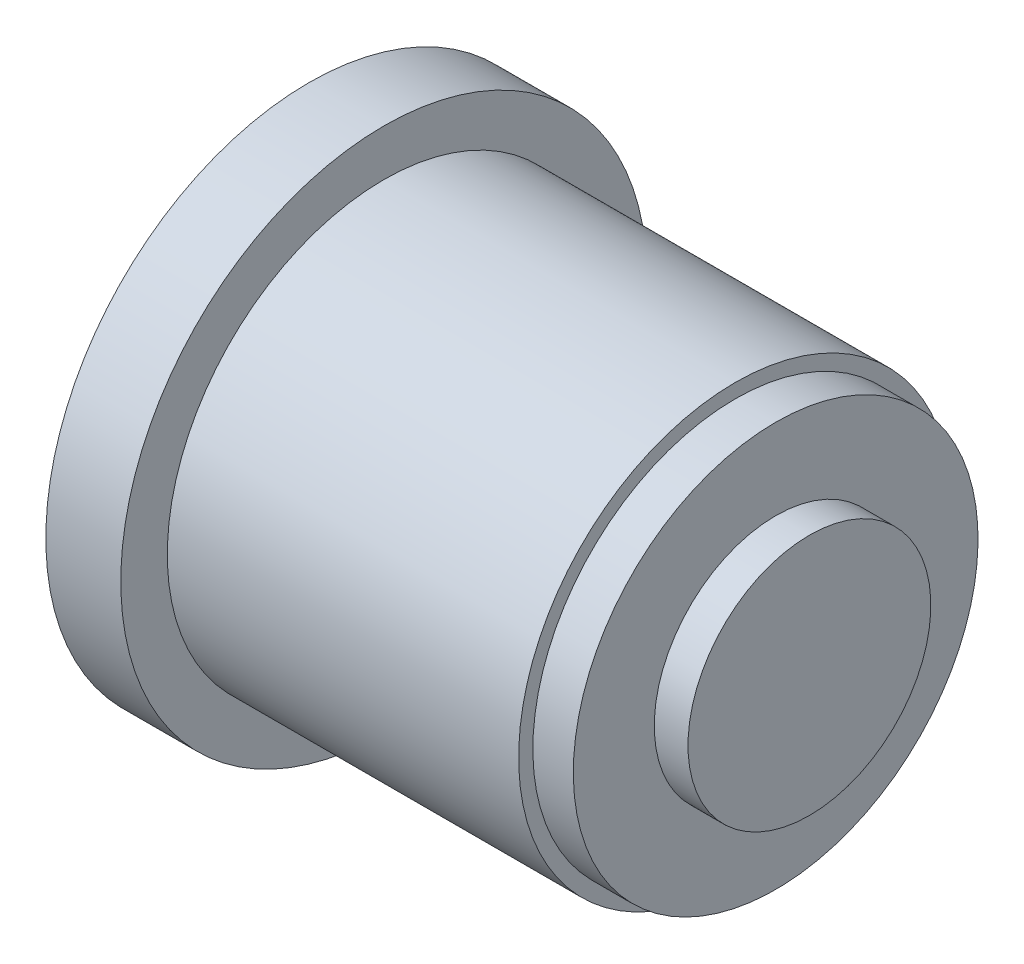
ISO-10303-21;
HEADER;
FILE_DESCRIPTION(('STEP AP214'),'2;1');
FILE_NAME('part.step','',(''),(''),'','','');
FILE_SCHEMA(('AUTOMOTIVE_DESIGN { 1 0 10303 214 1 1 1 1 }'));
ENDSEC;
DATA;
#1=APPLICATION_CONTEXT('core data for automotive mechanical design processes');
#2=APPLICATION_PROTOCOL_DEFINITION('international standard','automotive_design',2000,#1);
#3=PRODUCT_CONTEXT('',#1,'mechanical');
#4=PRODUCT('Part','Part','',(#3));
#5=PRODUCT_RELATED_PRODUCT_CATEGORY('part','',(#4));
#6=PRODUCT_DEFINITION_FORMATION('','',#4);
#7=PRODUCT_DEFINITION_CONTEXT('part definition',#1,'design');
#8=PRODUCT_DEFINITION('design','',#6,#7);
#9=PRODUCT_DEFINITION_SHAPE('','',#8);
#10=(LENGTH_UNIT() NAMED_UNIT(*) SI_UNIT(.MILLI.,.METRE.));
#11=(NAMED_UNIT(*) PLANE_ANGLE_UNIT() SI_UNIT($,.RADIAN.));
#12=(NAMED_UNIT(*) SI_UNIT($,.STERADIAN.) SOLID_ANGLE_UNIT());
#13=UNCERTAINTY_MEASURE_WITH_UNIT(LENGTH_MEASURE(1.E-05),#10,'distance_accuracy_value','');
#14=(GEOMETRIC_REPRESENTATION_CONTEXT(3) GLOBAL_UNCERTAINTY_ASSIGNED_CONTEXT((#13)) GLOBAL_UNIT_ASSIGNED_CONTEXT((#10,
#11,#12)) REPRESENTATION_CONTEXT('',''));
#15=CARTESIAN_POINT('',(0.,0.,0.));
#16=DIRECTION('',(0.,0.,1.));
#17=DIRECTION('',(1.,0.,0.));
#18=AXIS2_PLACEMENT_3D('',#15,#16,#17);
#19=CARTESIAN_POINT('',(37.1,0.,0.));
#20=DIRECTION('',(-1.,0.,0.));
#21=DIRECTION('',(0.,-1.,0.));
#22=AXIS2_PLACEMENT_3D('',#19,#20,#21);
#23=PLANE('',#22);
#24=CARTESIAN_POINT('',(37.1,0.,0.));
#25=DIRECTION('',(1.,0.,0.));
#26=DIRECTION('',(0.,1.,0.));
#27=AXIS2_PLACEMENT_3D('',#24,#25,#26);
#28=CIRCLE('',#27,9.);
#29=CARTESIAN_POINT('',(37.1,9.,0.));
#30=VERTEX_POINT('',#29);
#31=EDGE_CURVE('E10',#30,#30,#28,.T.);
#32=ORIENTED_EDGE('',*,*,#31,.T.);
#33=EDGE_LOOP('',(#32));
#34=FACE_BOUND('',#33,.T.);
#35=ADVANCED_FACE('F32',(#34),#23,.F.);
#36=CARTESIAN_POINT('',(33.5,0.,0.));
#37=DIRECTION('',(1.,0.,0.));
#38=DIRECTION('',(0.,1.,0.));
#39=AXIS2_PLACEMENT_3D('',#36,#37,#38);
#40=CYLINDRICAL_SURFACE('',#39,9.);
#41=ORIENTED_EDGE('',*,*,#31,.F.);
#42=EDGE_LOOP('',(#41));
#43=FACE_BOUND('',#42,.T.);
#44=CARTESIAN_POINT('',(34.6,0.,0.));
#45=DIRECTION('',(1.,0.,0.));
#46=DIRECTION('',(0.,1.,0.));
#47=AXIS2_PLACEMENT_3D('',#44,#45,#46);
#48=CIRCLE('',#47,9.);
#49=CARTESIAN_POINT('',(34.6,9.,0.));
#50=VERTEX_POINT('',#49);
#51=EDGE_CURVE('E38',#50,#50,#48,.T.);
#52=ORIENTED_EDGE('',*,*,#51,.T.);
#53=EDGE_LOOP('',(#52));
#54=FACE_BOUND('',#53,.T.);
#55=ADVANCED_FACE('F76',(#43,#54),#40,.T.);
#56=CARTESIAN_POINT('',(34.6,0.,0.));
#57=DIRECTION('',(-1.,0.,0.));
#58=DIRECTION('',(0.,-1.,0.));
#59=AXIS2_PLACEMENT_3D('',#56,#57,#58);
#60=PLANE('',#59);
#61=ORIENTED_EDGE('',*,*,#51,.F.);
#62=EDGE_LOOP('',(#61));
#63=FACE_BOUND('',#62,.T.);
#64=CARTESIAN_POINT('',(34.6,0.,0.));
#65=DIRECTION('',(1.,0.,0.));
#66=DIRECTION('',(0.,1.,0.));
#67=AXIS2_PLACEMENT_3D('',#64,#65,#66);
#68=CIRCLE('',#67,15.);
#69=CARTESIAN_POINT('',(34.6,15.,0.));
#70=VERTEX_POINT('',#69);
#71=EDGE_CURVE('E42',#70,#70,#68,.T.);
#72=ORIENTED_EDGE('',*,*,#71,.T.);
#73=EDGE_LOOP('',(#72));
#74=FACE_BOUND('',#73,.T.);
#75=ADVANCED_FACE('F80',(#63,#74),#60,.F.);
#76=CARTESIAN_POINT('',(33.5,0.,0.));
#77=DIRECTION('',(1.,0.,0.));
#78=DIRECTION('',(0.,1.,0.));
#79=AXIS2_PLACEMENT_3D('',#76,#77,#78);
#80=CYLINDRICAL_SURFACE('',#79,15.);
#81=ORIENTED_EDGE('',*,*,#71,.F.);
#82=EDGE_LOOP('',(#81));
#83=FACE_BOUND('',#82,.T.);
#84=CARTESIAN_POINT('',(31.6,0.,0.));
#85=DIRECTION('',(1.,0.,0.));
#86=DIRECTION('',(0.,1.,0.));
#87=AXIS2_PLACEMENT_3D('',#84,#85,#86);
#88=CIRCLE('',#87,15.);
#89=CARTESIAN_POINT('',(31.6,15.,0.));
#90=VERTEX_POINT('',#89);
#91=EDGE_CURVE('E46',#90,#90,#88,.T.);
#92=ORIENTED_EDGE('',*,*,#91,.T.);
#93=EDGE_LOOP('',(#92));
#94=FACE_BOUND('',#93,.T.);
#95=ADVANCED_FACE('F85',(#83,#94),#80,.T.);
#96=CARTESIAN_POINT('',(31.6,0.,0.));
#97=DIRECTION('',(-1.,0.,0.));
#98=DIRECTION('',(0.,-1.,0.));
#99=AXIS2_PLACEMENT_3D('',#96,#97,#98);
#100=PLANE('',#99);
#101=ORIENTED_EDGE('',*,*,#91,.F.);
#102=EDGE_LOOP('',(#101));
#103=FACE_BOUND('',#102,.T.);
#104=CARTESIAN_POINT('',(31.6,0.,0.));
#105=DIRECTION('',(1.,0.,0.));
#106=DIRECTION('',(0.,1.,0.));
#107=AXIS2_PLACEMENT_3D('',#104,#105,#106);
#108=CIRCLE('',#107,16.0532049205272);
#109=CARTESIAN_POINT('',(31.6,16.0532049205272,0.));
#110=VERTEX_POINT('',#109);
#111=EDGE_CURVE('E51',#110,#110,#108,.T.);
#112=ORIENTED_EDGE('',*,*,#111,.T.);
#113=EDGE_LOOP('',(#112));
#114=FACE_BOUND('',#113,.T.);
#115=ADVANCED_FACE('F91',(#103,#114),#100,.F.);
#116=CARTESIAN_POINT('',(33.5,0.,0.));
#117=DIRECTION('',(1.,0.,0.));
#118=DIRECTION('',(0.,1.,0.));
#119=AXIS2_PLACEMENT_3D('',#116,#117,#118);
#120=CYLINDRICAL_SURFACE('',#119,16.0532049205272);
#121=ORIENTED_EDGE('',*,*,#111,.F.);
#122=EDGE_LOOP('',(#121));
#123=FACE_BOUND('',#122,.T.);
#124=CARTESIAN_POINT('',(5.55669898163731,0.,0.));
#125=DIRECTION('',(1.,0.,0.));
#126=DIRECTION('',(0.,1.,0.));
#127=AXIS2_PLACEMENT_3D('',#124,#125,#126);
#128=CIRCLE('',#127,16.0532049205272);
#129=CARTESIAN_POINT('',(5.55669898163731,16.0532049205272,0.));
#130=VERTEX_POINT('',#129);
#131=EDGE_CURVE('E54',#130,#130,#128,.T.);
#132=ORIENTED_EDGE('',*,*,#131,.T.);
#133=EDGE_LOOP('',(#132));
#134=FACE_BOUND('',#133,.T.);
#135=ADVANCED_FACE('F95',(#123,#134),#120,.T.);
#136=CARTESIAN_POINT('',(5.55669898163731,0.,0.));
#137=DIRECTION('',(-1.,0.,0.));
#138=DIRECTION('',(0.,-1.,0.));
#139=AXIS2_PLACEMENT_3D('',#136,#137,#138);
#140=PLANE('',#139);
#141=ORIENTED_EDGE('',*,*,#131,.F.);
#142=EDGE_LOOP('',(#141));
#143=FACE_BOUND('',#142,.T.);
#144=CARTESIAN_POINT('',(5.55669898163731,0.,0.));
#145=DIRECTION('',(1.,0.,0.));
#146=DIRECTION('',(0.,1.,0.));
#147=AXIS2_PLACEMENT_3D('',#144,#145,#146);
#148=CIRCLE('',#147,19.5);
#149=CARTESIAN_POINT('',(5.55669898163731,19.5,0.));
#150=VERTEX_POINT('',#149);
#151=EDGE_CURVE('E57',#150,#150,#148,.T.);
#152=ORIENTED_EDGE('',*,*,#151,.T.);
#153=EDGE_LOOP('',(#152));
#154=FACE_BOUND('',#153,.T.);
#155=ADVANCED_FACE('F72',(#143,#154),#140,.F.);
#156=CARTESIAN_POINT('',(33.5,0.,0.));
#157=DIRECTION('',(1.,0.,0.));
#158=DIRECTION('',(0.,1.,0.));
#159=AXIS2_PLACEMENT_3D('',#156,#157,#158);
#160=CYLINDRICAL_SURFACE('',#159,19.5);
#161=ORIENTED_EDGE('',*,*,#151,.F.);
#162=EDGE_LOOP('',(#161));
#163=FACE_BOUND('',#162,.T.);
#164=CARTESIAN_POINT('',(0.,0.,0.));
#165=DIRECTION('',(1.,0.,0.));
#166=DIRECTION('',(0.,1.,0.));
#167=AXIS2_PLACEMENT_3D('',#164,#165,#166);
#168=CIRCLE('',#167,19.5);
#169=CARTESIAN_POINT('',(0.,19.5,0.));
#170=VERTEX_POINT('',#169);
#171=EDGE_CURVE('E60',#170,#170,#168,.T.);
#172=ORIENTED_EDGE('',*,*,#171,.T.);
#173=EDGE_LOOP('',(#172));
#174=FACE_BOUND('',#173,.T.);
#175=ADVANCED_FACE('F64',(#163,#174),#160,.T.);
#176=CARTESIAN_POINT('',(0.,0.,0.));
#177=DIRECTION('',(1.,0.,0.));
#178=DIRECTION('',(0.,1.,0.));
#179=AXIS2_PLACEMENT_3D('',#176,#177,#178);
#180=PLANE('',#179);
#181=ORIENTED_EDGE('',*,*,#171,.F.);
#182=EDGE_LOOP('',(#181));
#183=FACE_BOUND('',#182,.T.);
#184=ADVANCED_FACE('F66',(#183),#180,.F.);
#185=CLOSED_SHELL('',(#35,#55,#75,#95,#115,#135,#155,#175,#184));
#186=MANIFOLD_SOLID_BREP('B2',#185);
#187=ADVANCED_BREP_SHAPE_REPRESENTATION('',(#18,#186),#14);
#188=SHAPE_DEFINITION_REPRESENTATION(#9,#187);
ENDSEC;
END-ISO-10303-21;
